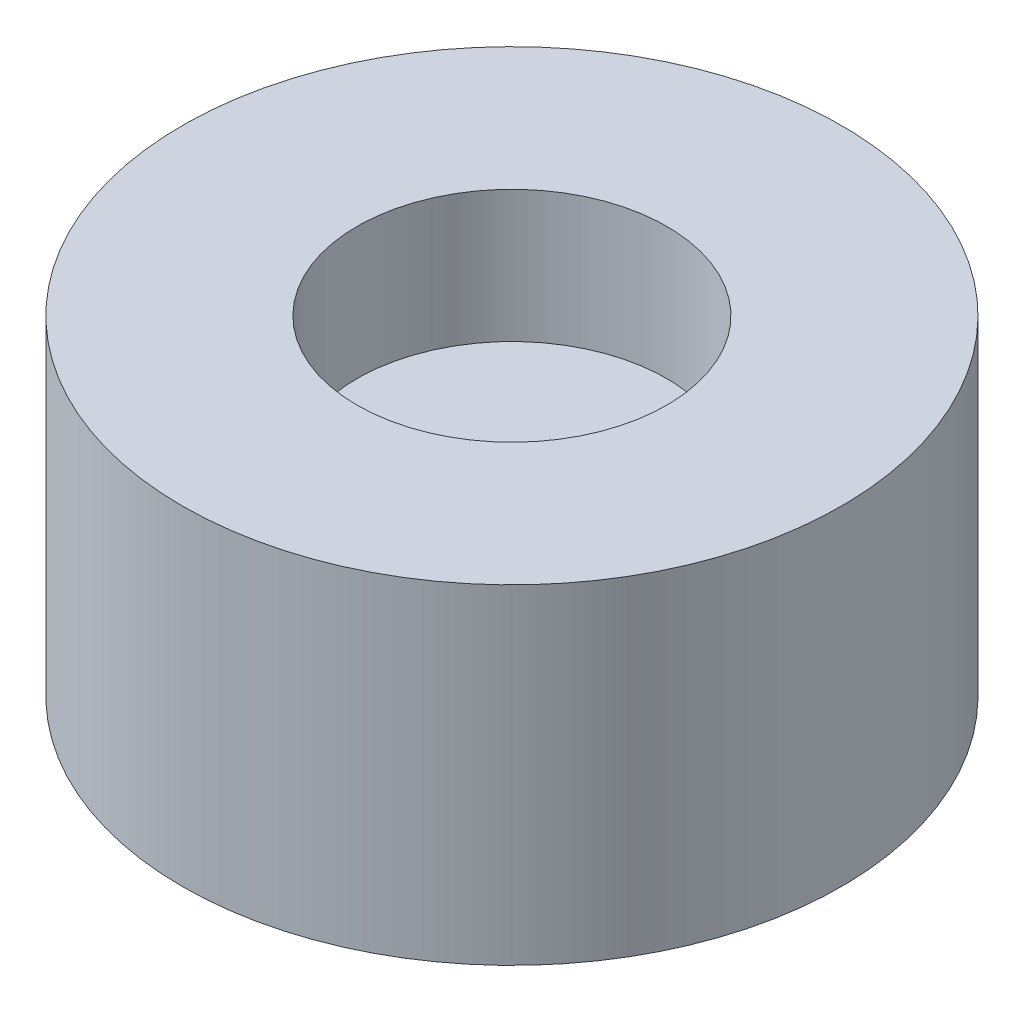
ISO-10303-21;
HEADER;
FILE_DESCRIPTION(('STEP AP214'),'2;1');
FILE_NAME('part.step','',(''),(''),'','','');
FILE_SCHEMA(('AUTOMOTIVE_DESIGN { 1 0 10303 214 1 1 1 1 }'));
ENDSEC;
DATA;
#1=APPLICATION_CONTEXT('core data for automotive mechanical design processes');
#2=APPLICATION_PROTOCOL_DEFINITION('international standard','automotive_design',2000,#1);
#3=PRODUCT_CONTEXT('',#1,'mechanical');
#4=PRODUCT('Part','Part','',(#3));
#5=PRODUCT_RELATED_PRODUCT_CATEGORY('part','',(#4));
#6=PRODUCT_DEFINITION_FORMATION('','',#4);
#7=PRODUCT_DEFINITION_CONTEXT('part definition',#1,'design');
#8=PRODUCT_DEFINITION('design','',#6,#7);
#9=PRODUCT_DEFINITION_SHAPE('','',#8);
#10=(LENGTH_UNIT() NAMED_UNIT(*) SI_UNIT(.MILLI.,.METRE.));
#11=(NAMED_UNIT(*) PLANE_ANGLE_UNIT() SI_UNIT($,.RADIAN.));
#12=(NAMED_UNIT(*) SI_UNIT($,.STERADIAN.) SOLID_ANGLE_UNIT());
#13=UNCERTAINTY_MEASURE_WITH_UNIT(LENGTH_MEASURE(1.E-05),#10,'distance_accuracy_value','');
#14=(GEOMETRIC_REPRESENTATION_CONTEXT(3) GLOBAL_UNCERTAINTY_ASSIGNED_CONTEXT((#13)) GLOBAL_UNIT_ASSIGNED_CONTEXT((#10,
#11,#12)) REPRESENTATION_CONTEXT('',''));
#15=CARTESIAN_POINT('',(0.,0.,0.));
#16=DIRECTION('',(0.,0.,1.));
#17=DIRECTION('',(1.,0.,0.));
#18=AXIS2_PLACEMENT_3D('',#15,#16,#17);
#19=CARTESIAN_POINT('',(0.,12.7,0.));
#20=DIRECTION('',(0.,-1.,0.));
#21=DIRECTION('',(0.,0.,-1.));
#22=AXIS2_PLACEMENT_3D('',#19,#20,#21);
#23=CYLINDRICAL_SURFACE('',#22,12.7);
#24=CARTESIAN_POINT('',(0.,12.7,0.));
#25=DIRECTION('',(0.,1.,0.));
#26=DIRECTION('',(0.,0.,1.));
#27=AXIS2_PLACEMENT_3D('',#24,#25,#26);
#28=CIRCLE('',#27,12.7);
#29=CARTESIAN_POINT('',(0.,12.7,12.7));
#30=VERTEX_POINT('',#29);
#31=EDGE_CURVE('E10',#30,#30,#28,.T.);
#32=ORIENTED_EDGE('',*,*,#31,.F.);
#33=EDGE_LOOP('',(#32));
#34=FACE_BOUND('',#33,.T.);
#35=CARTESIAN_POINT('',(0.,0.,0.));
#36=DIRECTION('',(0.,1.,0.));
#37=DIRECTION('',(0.,0.,1.));
#38=AXIS2_PLACEMENT_3D('',#35,#36,#37);
#39=CIRCLE('',#38,12.7);
#40=CARTESIAN_POINT('',(0.,0.,12.7));
#41=VERTEX_POINT('',#40);
#42=EDGE_CURVE('E38',#41,#41,#39,.T.);
#43=ORIENTED_EDGE('',*,*,#42,.T.);
#44=EDGE_LOOP('',(#43));
#45=FACE_BOUND('',#44,.T.);
#46=ADVANCED_FACE('F35',(#34,#45),#23,.T.);
#47=CARTESIAN_POINT('',(0.,12.7,0.));
#48=DIRECTION('',(0.,1.,0.));
#49=DIRECTION('',(0.,0.,1.));
#50=AXIS2_PLACEMENT_3D('',#47,#48,#49);
#51=PLANE('',#50);
#52=CARTESIAN_POINT('',(0.,12.7,0.));
#53=DIRECTION('',(0.,1.,0.));
#54=DIRECTION('',(0.,0.,1.));
#55=AXIS2_PLACEMENT_3D('',#52,#53,#54);
#56=CIRCLE('',#55,5.969);
#57=CARTESIAN_POINT('',(0.,12.7,5.969));
#58=VERTEX_POINT('',#57);
#59=EDGE_CURVE('E47',#58,#58,#56,.T.);
#60=ORIENTED_EDGE('',*,*,#59,.F.);
#61=EDGE_LOOP('',(#60));
#62=FACE_BOUND('',#61,.T.);
#63=ORIENTED_EDGE('',*,*,#31,.T.);
#64=EDGE_LOOP('',(#63));
#65=FACE_BOUND('',#64,.T.);
#66=ADVANCED_FACE('F62',(#62,#65),#51,.T.);
#67=CARTESIAN_POINT('',(0.,0.,0.));
#68=DIRECTION('',(0.,1.,0.));
#69=DIRECTION('',(0.,0.,1.));
#70=AXIS2_PLACEMENT_3D('',#67,#68,#69);
#71=PLANE('',#70);
#72=ORIENTED_EDGE('',*,*,#42,.F.);
#73=EDGE_LOOP('',(#72));
#74=FACE_BOUND('',#73,.T.);
#75=ADVANCED_FACE('F58',(#74),#71,.F.);
#76=CARTESIAN_POINT('',(0.,7.62,0.));
#77=DIRECTION('',(0.,1.,0.));
#78=DIRECTION('',(0.,0.,1.));
#79=AXIS2_PLACEMENT_3D('',#76,#77,#78);
#80=CYLINDRICAL_SURFACE('',#79,5.969);
#81=CARTESIAN_POINT('',(0.,7.62,0.));
#82=DIRECTION('',(0.,1.,0.));
#83=DIRECTION('',(0.,0.,1.));
#84=AXIS2_PLACEMENT_3D('',#81,#82,#83);
#85=CIRCLE('',#84,5.969);
#86=CARTESIAN_POINT('',(0.,7.62,5.969));
#87=VERTEX_POINT('',#86);
#88=EDGE_CURVE('E45',#87,#87,#85,.T.);
#89=ORIENTED_EDGE('',*,*,#88,.F.);
#90=EDGE_LOOP('',(#89));
#91=FACE_BOUND('',#90,.T.);
#92=ORIENTED_EDGE('',*,*,#59,.T.);
#93=EDGE_LOOP('',(#92));
#94=FACE_BOUND('',#93,.T.);
#95=ADVANCED_FACE('F55',(#91,#94),#80,.F.);
#96=CARTESIAN_POINT('',(0.,7.62,0.));
#97=DIRECTION('',(0.,1.,0.));
#98=DIRECTION('',(0.,0.,1.));
#99=AXIS2_PLACEMENT_3D('',#96,#97,#98);
#100=PLANE('',#99);
#101=ORIENTED_EDGE('',*,*,#88,.T.);
#102=EDGE_LOOP('',(#101));
#103=FACE_BOUND('',#102,.T.);
#104=ADVANCED_FACE('F53',(#103),#100,.T.);
#105=CLOSED_SHELL('',(#46,#66,#75,#95,#104));
#106=MANIFOLD_SOLID_BREP('B2',#105);
#107=ADVANCED_BREP_SHAPE_REPRESENTATION('',(#18,#106),#14);
#108=SHAPE_DEFINITION_REPRESENTATION(#9,#107);
ENDSEC;
END-ISO-10303-21;
